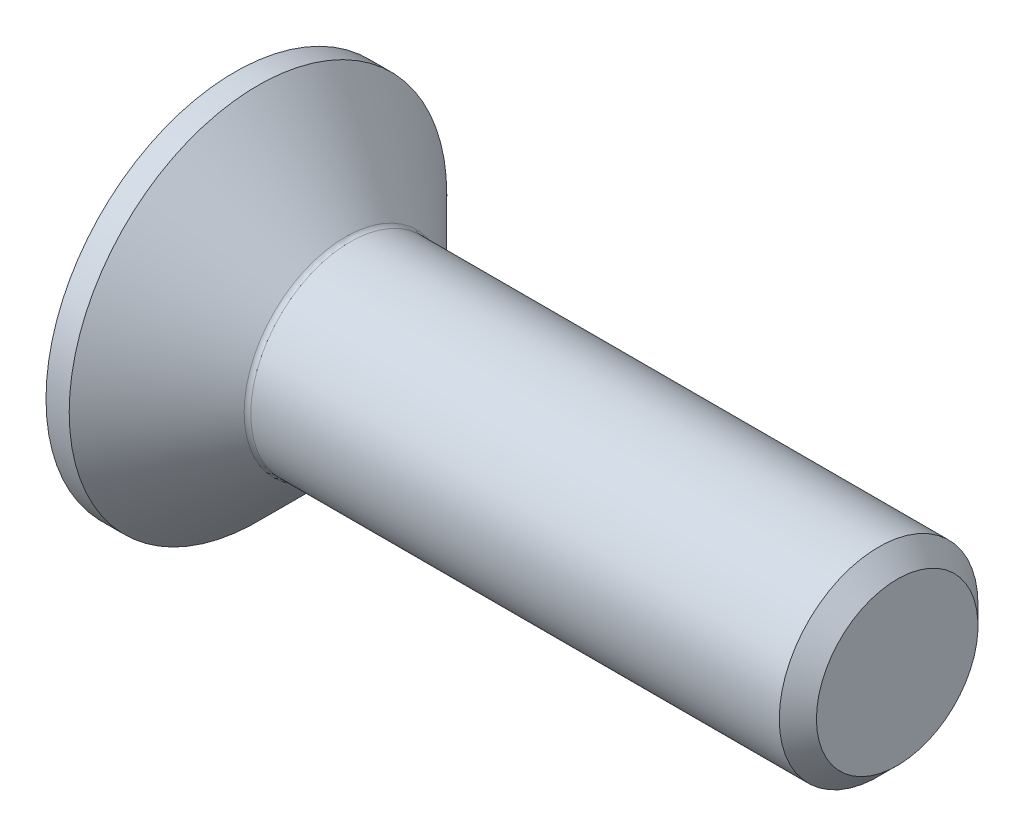
ISO-10303-21;
HEADER;
FILE_DESCRIPTION(('STEP AP214'),'2;1');
FILE_NAME('part.step','',(''),(''),'','','');
FILE_SCHEMA(('AUTOMOTIVE_DESIGN { 1 0 10303 214 1 1 1 1 }'));
ENDSEC;
DATA;
#1=APPLICATION_CONTEXT('core data for automotive mechanical design processes');
#2=APPLICATION_PROTOCOL_DEFINITION('international standard','automotive_design',2000,#1);
#3=PRODUCT_CONTEXT('',#1,'mechanical');
#4=PRODUCT('Part','Part','',(#3));
#5=PRODUCT_RELATED_PRODUCT_CATEGORY('part','',(#4));
#6=PRODUCT_DEFINITION_FORMATION('','',#4);
#7=PRODUCT_DEFINITION_CONTEXT('part definition',#1,'design');
#8=PRODUCT_DEFINITION('design','',#6,#7);
#9=PRODUCT_DEFINITION_SHAPE('','',#8);
#10=(LENGTH_UNIT() NAMED_UNIT(*) SI_UNIT(.MILLI.,.METRE.));
#11=(NAMED_UNIT(*) PLANE_ANGLE_UNIT() SI_UNIT($,.RADIAN.));
#12=(NAMED_UNIT(*) SI_UNIT($,.STERADIAN.) SOLID_ANGLE_UNIT());
#13=UNCERTAINTY_MEASURE_WITH_UNIT(LENGTH_MEASURE(1.E-05),#10,'distance_accuracy_value','');
#14=(GEOMETRIC_REPRESENTATION_CONTEXT(3) GLOBAL_UNCERTAINTY_ASSIGNED_CONTEXT((#13)) GLOBAL_UNIT_ASSIGNED_CONTEXT((#10,
#11,#12)) REPRESENTATION_CONTEXT('',''));
#15=CARTESIAN_POINT('',(0.,0.,0.));
#16=DIRECTION('',(0.,0.,1.));
#17=DIRECTION('',(1.,0.,0.));
#18=AXIS2_PLACEMENT_3D('',#15,#16,#17);
#19=CARTESIAN_POINT('',(0.,0.,0.));
#20=DIRECTION('',(-1.,0.,0.));
#21=DIRECTION('',(0.,0.,1.));
#22=AXIS2_PLACEMENT_3D('',#19,#20,#21);
#23=PLANE('',#22);
#24=CARTESIAN_POINT('',(0.,0.,0.));
#25=DIRECTION('',(-1.,0.,0.));
#26=DIRECTION('',(0.,0.,1.));
#27=AXIS2_PLACEMENT_3D('',#24,#25,#26);
#28=CIRCLE('',#27,2.85);
#29=CARTESIAN_POINT('',(0.,0.,2.85));
#30=VERTEX_POINT('',#29);
#31=EDGE_CURVE('E156',#30,#30,#28,.T.);
#32=ORIENTED_EDGE('',*,*,#31,.T.);
#33=EDGE_LOOP('',(#32));
#34=FACE_BOUND('',#33,.T.);
#35=DIRECTION('',(0.,-0.5,-0.866025403784439));
#36=VECTOR('',#35,1.);
#37=CARTESIAN_POINT('',(0.,-0.583123771881522,1.01));
#38=LINE('',#37,#36);
#39=CARTESIAN_POINT('',(0.,-0.583123771881522,1.01));
#40=VERTEX_POINT('',#39);
#41=CARTESIAN_POINT('',(0.,-1.16624754376304,0.));
#42=VERTEX_POINT('',#41);
#43=EDGE_CURVE('E122',#40,#42,#38,.T.);
#44=ORIENTED_EDGE('',*,*,#43,.T.);
#45=DIRECTION('',(0.,0.5,-0.866025403784439));
#46=VECTOR('',#45,1.);
#47=CARTESIAN_POINT('',(0.,-1.16624754376304,0.));
#48=LINE('',#47,#46);
#49=CARTESIAN_POINT('',(0.,-0.583123771881522,-1.01));
#50=VERTEX_POINT('',#49);
#51=EDGE_CURVE('E53',#42,#50,#48,.T.);
#52=ORIENTED_EDGE('',*,*,#51,.T.);
#53=DIRECTION('',(0.,1.,0.));
#54=VECTOR('',#53,1.);
#55=CARTESIAN_POINT('',(0.,-0.583123771881522,-1.01));
#56=LINE('',#55,#54);
#57=CARTESIAN_POINT('',(0.,0.583123771881523,-1.01));
#58=VERTEX_POINT('',#57);
#59=EDGE_CURVE('E133',#50,#58,#56,.T.);
#60=ORIENTED_EDGE('',*,*,#59,.T.);
#61=DIRECTION('',(0.,0.5,0.866025403784439));
#62=VECTOR('',#61,1.);
#63=CARTESIAN_POINT('',(0.,0.583123771881523,-1.01));
#64=LINE('',#63,#62);
#65=CARTESIAN_POINT('',(0.,1.16624754376304,0.));
#66=VERTEX_POINT('',#65);
#67=EDGE_CURVE('E257',#58,#66,#64,.T.);
#68=ORIENTED_EDGE('',*,*,#67,.T.);
#69=DIRECTION('',(0.,-0.5,0.866025403784439));
#70=VECTOR('',#69,1.);
#71=CARTESIAN_POINT('',(0.,1.16624754376304,0.));
#72=LINE('',#71,#70);
#73=CARTESIAN_POINT('',(0.,0.583123771881523,1.01));
#74=VERTEX_POINT('',#73);
#75=EDGE_CURVE('E260',#66,#74,#72,.T.);
#76=ORIENTED_EDGE('',*,*,#75,.T.);
#77=DIRECTION('',(0.,-1.,0.));
#78=VECTOR('',#77,1.);
#79=CARTESIAN_POINT('',(0.,0.583123771881523,1.01));
#80=LINE('',#79,#78);
#81=EDGE_CURVE('E263',#74,#40,#80,.T.);
#82=ORIENTED_EDGE('',*,*,#81,.T.);
#83=EDGE_LOOP('',(#44,#52,#60,#68,#76,#82));
#84=FACE_BOUND('',#83,.T.);
#85=ADVANCED_FACE('F38',(#34,#84),#23,.T.);
#86=CARTESIAN_POINT('',(0.,0.,0.));
#87=DIRECTION('',(-1.,0.,0.));
#88=DIRECTION('',(0.,0.,1.));
#89=AXIS2_PLACEMENT_3D('',#86,#87,#88);
#90=CYLINDRICAL_SURFACE('',#89,2.85);
#91=CARTESIAN_POINT('',(0.350000000000006,0.,0.));
#92=DIRECTION('',(-1.,0.,0.));
#93=DIRECTION('',(0.,0.,1.));
#94=AXIS2_PLACEMENT_3D('',#91,#92,#93);
#95=CIRCLE('',#94,2.85);
#96=CARTESIAN_POINT('',(0.350000000000006,0.,2.85));
#97=VERTEX_POINT('',#96);
#98=EDGE_CURVE('E153',#97,#97,#95,.T.);
#99=ORIENTED_EDGE('',*,*,#98,.T.);
#100=EDGE_LOOP('',(#99));
#101=FACE_BOUND('',#100,.T.);
#102=ORIENTED_EDGE('',*,*,#31,.F.);
#103=EDGE_LOOP('',(#102));
#104=FACE_BOUND('',#103,.T.);
#105=ADVANCED_FACE('F177',(#101,#104),#90,.T.);
#106=CARTESIAN_POINT('',(0.350000000000006,0.,0.));
#107=DIRECTION('',(-1.,0.,0.));
#108=DIRECTION('',(0.,0.,1.));
#109=AXIS2_PLACEMENT_3D('',#106,#107,#108);
#110=CONICAL_SURFACE('',#109,2.85,0.78539816339745);
#111=CARTESIAN_POINT('',(1.67071067811868,0.,0.));
#112=DIRECTION('',(-1.,0.,0.));
#113=DIRECTION('',(0.,0.,1.));
#114=AXIS2_PLACEMENT_3D('',#111,#112,#113);
#115=CIRCLE('',#114,1.52928932188132);
#116=CARTESIAN_POINT('',(1.67071067811868,0.,1.52928932188132));
#117=VERTEX_POINT('',#116);
#118=EDGE_CURVE('E46',#117,#117,#115,.T.);
#119=ORIENTED_EDGE('',*,*,#118,.T.);
#120=EDGE_LOOP('',(#119));
#121=FACE_BOUND('',#120,.T.);
#122=ORIENTED_EDGE('',*,*,#98,.F.);
#123=EDGE_LOOP('',(#122));
#124=FACE_BOUND('',#123,.T.);
#125=ADVANCED_FACE('F161',(#121,#124),#110,.T.);
#126=CARTESIAN_POINT('',(0.,0.,0.));
#127=DIRECTION('',(-1.,0.,0.));
#128=DIRECTION('',(0.,0.,1.));
#129=AXIS2_PLACEMENT_3D('',#126,#127,#128);
#130=CYLINDRICAL_SURFACE('',#129,1.49999999999998);
#131=CARTESIAN_POINT('',(1.74142135623733,0.,0.));
#132=DIRECTION('',(-1.,0.,0.));
#133=DIRECTION('',(0.,0.,1.));
#134=AXIS2_PLACEMENT_3D('',#131,#132,#133);
#135=CIRCLE('',#134,1.49999999999998);
#136=CARTESIAN_POINT('',(1.74142135623733,0.,1.49999999999998));
#137=VERTEX_POINT('',#136);
#138=EDGE_CURVE('E11',#137,#137,#135,.F.);
#139=ORIENTED_EDGE('',*,*,#138,.T.);
#140=EDGE_LOOP('',(#139));
#141=FACE_BOUND('',#140,.T.);
#142=CARTESIAN_POINT('',(9.71949999999996,0.,0.));
#143=DIRECTION('',(-1.,0.,0.));
#144=DIRECTION('',(0.,0.,1.));
#145=AXIS2_PLACEMENT_3D('',#142,#143,#144);
#146=CIRCLE('',#145,1.49999999999995);
#147=CARTESIAN_POINT('',(9.71949999999996,0.,1.49999999999995));
#148=VERTEX_POINT('',#147);
#149=EDGE_CURVE('E150',#148,#148,#146,.T.);
#150=ORIENTED_EDGE('',*,*,#149,.T.);
#151=EDGE_LOOP('',(#150));
#152=FACE_BOUND('',#151,.T.);
#153=ADVANCED_FACE('F188',(#141,#152),#130,.T.);
#154=CARTESIAN_POINT('',(10.,0.,0.));
#155=DIRECTION('',(-1.,0.,0.));
#156=DIRECTION('',(0.,0.,1.));
#157=AXIS2_PLACEMENT_3D('',#154,#155,#156);
#158=CONICAL_SURFACE('',#157,1.2195,0.785398163397301);
#159=ORIENTED_EDGE('',*,*,#149,.F.);
#160=EDGE_LOOP('',(#159));
#161=FACE_BOUND('',#160,.T.);
#162=CARTESIAN_POINT('',(10.,0.,0.));
#163=DIRECTION('',(-1.,0.,0.));
#164=DIRECTION('',(0.,0.,1.));
#165=AXIS2_PLACEMENT_3D('',#162,#163,#164);
#166=CIRCLE('',#165,1.2195);
#167=CARTESIAN_POINT('',(10.,0.,1.2195));
#168=VERTEX_POINT('',#167);
#169=EDGE_CURVE('E146',#168,#168,#166,.T.);
#170=ORIENTED_EDGE('',*,*,#169,.T.);
#171=EDGE_LOOP('',(#170));
#172=FACE_BOUND('',#171,.T.);
#173=ADVANCED_FACE('F172',(#161,#172),#158,.T.);
#174=CARTESIAN_POINT('',(10.,1.2195,0.));
#175=DIRECTION('',(1.,0.,0.));
#176=DIRECTION('',(0.,0.,-1.));
#177=AXIS2_PLACEMENT_3D('',#174,#175,#176);
#178=PLANE('',#177);
#179=ORIENTED_EDGE('',*,*,#169,.F.);
#180=EDGE_LOOP('',(#179));
#181=FACE_BOUND('',#180,.T.);
#182=ADVANCED_FACE('F165',(#181),#178,.T.);
#183=CARTESIAN_POINT('',(1.74142135623733,0.,0.));
#184=DIRECTION('',(-1.,0.,0.));
#185=DIRECTION('',(0.,0.,1.));
#186=AXIS2_PLACEMENT_3D('',#183,#184,#185);
#187=TOROIDAL_SURFACE('',#186,1.59999999999998,0.1);
#188=ORIENTED_EDGE('',*,*,#138,.F.);
#189=EDGE_LOOP('',(#188));
#190=FACE_BOUND('',#189,.T.);
#191=ORIENTED_EDGE('',*,*,#118,.F.);
#192=EDGE_LOOP('',(#191));
#193=FACE_BOUND('',#192,.T.);
#194=ADVANCED_FACE('F40',(#190,#193),#187,.F.);
#195=CARTESIAN_POINT('',(1.2,-1.16624754376304,0.));
#196=DIRECTION('',(0.,0.866025403784439,0.5));
#197=DIRECTION('',(0.,-0.5,0.866025403784439));
#198=AXIS2_PLACEMENT_3D('',#195,#196,#197);
#199=PLANE('',#198);
#200=ORIENTED_EDGE('',*,*,#51,.F.);
#201=DIRECTION('',(-1.,0.,0.));
#202=VECTOR('',#201,1.);
#203=CARTESIAN_POINT('',(1.2,-1.16624754376304,0.));
#204=LINE('',#203,#202);
#205=CARTESIAN_POINT('',(1.2,-1.16624754376304,0.));
#206=VERTEX_POINT('',#205);
#207=EDGE_CURVE('E254',#206,#42,#204,.T.);
#208=ORIENTED_EDGE('',*,*,#207,.F.);
#209=DIRECTION('',(0.,0.5,-0.866025403784439));
#210=VECTOR('',#209,1.);
#211=CARTESIAN_POINT('',(1.2,-1.16624754376304,0.));
#212=LINE('',#211,#210);
#213=CARTESIAN_POINT('',(1.2,-0.874685657822283,-0.505));
#214=VERTEX_POINT('',#213);
#215=EDGE_CURVE('E118',#206,#214,#212,.T.);
#216=ORIENTED_EDGE('',*,*,#215,.T.);
#217=CARTESIAN_POINT('',(1.2,-0.583123771881522,-1.01));
#218=VERTEX_POINT('',#217);
#219=EDGE_CURVE('E114',#214,#218,#212,.T.);
#220=ORIENTED_EDGE('',*,*,#219,.T.);
#221=DIRECTION('',(-1.,0.,0.));
#222=VECTOR('',#221,1.);
#223=CARTESIAN_POINT('',(1.2,-0.583123771881522,-1.01));
#224=LINE('',#223,#222);
#225=EDGE_CURVE('E116',#218,#50,#224,.T.);
#226=ORIENTED_EDGE('',*,*,#225,.T.);
#227=EDGE_LOOP('',(#200,#208,#216,#220,#226));
#228=FACE_BOUND('',#227,.T.);
#229=ADVANCED_FACE('F115',(#228),#199,.T.);
#230=CARTESIAN_POINT('',(1.2,-0.583123771881522,-1.01));
#231=DIRECTION('',(0.,0.,1.));
#232=DIRECTION('',(1.,0.,0.));
#233=AXIS2_PLACEMENT_3D('',#230,#231,#232);
#234=PLANE('',#233);
#235=ORIENTED_EDGE('',*,*,#59,.F.);
#236=ORIENTED_EDGE('',*,*,#225,.F.);
#237=DIRECTION('',(0.,1.,0.));
#238=VECTOR('',#237,1.);
#239=CARTESIAN_POINT('',(1.2,-0.583123771881522,-1.01));
#240=LINE('',#239,#238);
#241=CARTESIAN_POINT('',(1.2,0.,-1.01));
#242=VERTEX_POINT('',#241);
#243=EDGE_CURVE('E61',#218,#242,#240,.T.);
#244=ORIENTED_EDGE('',*,*,#243,.T.);
#245=CARTESIAN_POINT('',(1.2,0.583123771881523,-1.01));
#246=VERTEX_POINT('',#245);
#247=EDGE_CURVE('E128',#242,#246,#240,.T.);
#248=ORIENTED_EDGE('',*,*,#247,.T.);
#249=DIRECTION('',(-1.,0.,0.));
#250=VECTOR('',#249,1.);
#251=CARTESIAN_POINT('',(1.2,0.583123771881523,-1.01));
#252=LINE('',#251,#250);
#253=EDGE_CURVE('E135',#246,#58,#252,.T.);
#254=ORIENTED_EDGE('',*,*,#253,.T.);
#255=EDGE_LOOP('',(#235,#236,#244,#248,#254));
#256=FACE_BOUND('',#255,.T.);
#257=ADVANCED_FACE('F130',(#256),#234,.T.);
#258=CARTESIAN_POINT('',(1.2,0.583123771881523,-1.01));
#259=DIRECTION('',(0.,-0.866025403784439,0.5));
#260=DIRECTION('',(0.,-0.5,-0.866025403784439));
#261=AXIS2_PLACEMENT_3D('',#258,#259,#260);
#262=PLANE('',#261);
#263=ORIENTED_EDGE('',*,*,#67,.F.);
#264=ORIENTED_EDGE('',*,*,#253,.F.);
#265=DIRECTION('',(0.,0.5,0.866025403784439));
#266=VECTOR('',#265,1.);
#267=CARTESIAN_POINT('',(1.2,0.583123771881523,-1.01));
#268=LINE('',#267,#266);
#269=CARTESIAN_POINT('',(1.2,0.874685657822283,-0.505));
#270=VERTEX_POINT('',#269);
#271=EDGE_CURVE('E235',#246,#270,#268,.T.);
#272=ORIENTED_EDGE('',*,*,#271,.T.);
#273=CARTESIAN_POINT('',(1.2,1.16624754376304,0.));
#274=VERTEX_POINT('',#273);
#275=EDGE_CURVE('E127',#270,#274,#268,.T.);
#276=ORIENTED_EDGE('',*,*,#275,.T.);
#277=DIRECTION('',(-1.,0.,0.));
#278=VECTOR('',#277,1.);
#279=CARTESIAN_POINT('',(1.2,1.16624754376304,0.));
#280=LINE('',#279,#278);
#281=EDGE_CURVE('E141',#274,#66,#280,.T.);
#282=ORIENTED_EDGE('',*,*,#281,.T.);
#283=EDGE_LOOP('',(#263,#264,#272,#276,#282));
#284=FACE_BOUND('',#283,.T.);
#285=ADVANCED_FACE('F202',(#284),#262,.T.);
#286=CARTESIAN_POINT('',(1.2,1.16624754376304,0.));
#287=DIRECTION('',(0.,-0.866025403784439,-0.5));
#288=DIRECTION('',(0.,0.5,-0.866025403784439));
#289=AXIS2_PLACEMENT_3D('',#286,#287,#288);
#290=PLANE('',#289);
#291=ORIENTED_EDGE('',*,*,#75,.F.);
#292=ORIENTED_EDGE('',*,*,#281,.F.);
#293=DIRECTION('',(0.,-0.5,0.866025403784439));
#294=VECTOR('',#293,1.);
#295=CARTESIAN_POINT('',(1.2,1.16624754376304,0.));
#296=LINE('',#295,#294);
#297=CARTESIAN_POINT('',(1.2,0.874685657822284,0.505));
#298=VERTEX_POINT('',#297);
#299=EDGE_CURVE('E242',#274,#298,#296,.T.);
#300=ORIENTED_EDGE('',*,*,#299,.T.);
#301=CARTESIAN_POINT('',(1.2,0.583123771881523,1.01));
#302=VERTEX_POINT('',#301);
#303=EDGE_CURVE('E240',#298,#302,#296,.T.);
#304=ORIENTED_EDGE('',*,*,#303,.T.);
#305=DIRECTION('',(-1.,0.,0.));
#306=VECTOR('',#305,1.);
#307=CARTESIAN_POINT('',(1.2,0.583123771881523,1.01));
#308=LINE('',#307,#306);
#309=EDGE_CURVE('E272',#302,#74,#308,.T.);
#310=ORIENTED_EDGE('',*,*,#309,.T.);
#311=EDGE_LOOP('',(#291,#292,#300,#304,#310));
#312=FACE_BOUND('',#311,.T.);
#313=ADVANCED_FACE('F205',(#312),#290,.T.);
#314=CARTESIAN_POINT('',(1.2,0.583123771881523,1.01));
#315=DIRECTION('',(0.,0.,-1.));
#316=DIRECTION('',(-1.,0.,0.));
#317=AXIS2_PLACEMENT_3D('',#314,#315,#316);
#318=PLANE('',#317);
#319=ORIENTED_EDGE('',*,*,#81,.F.);
#320=ORIENTED_EDGE('',*,*,#309,.F.);
#321=DIRECTION('',(0.,-1.,0.));
#322=VECTOR('',#321,1.);
#323=CARTESIAN_POINT('',(1.2,0.583123771881523,1.01));
#324=LINE('',#323,#322);
#325=CARTESIAN_POINT('',(1.2,0.,1.01));
#326=VERTEX_POINT('',#325);
#327=EDGE_CURVE('E247',#302,#326,#324,.T.);
#328=ORIENTED_EDGE('',*,*,#327,.T.);
#329=CARTESIAN_POINT('',(1.2,-0.583123771881522,1.01));
#330=VERTEX_POINT('',#329);
#331=EDGE_CURVE('E246',#326,#330,#324,.T.);
#332=ORIENTED_EDGE('',*,*,#331,.T.);
#333=DIRECTION('',(-1.,0.,0.));
#334=VECTOR('',#333,1.);
#335=CARTESIAN_POINT('',(1.2,-0.583123771881522,1.01));
#336=LINE('',#335,#334);
#337=EDGE_CURVE('E269',#330,#40,#336,.T.);
#338=ORIENTED_EDGE('',*,*,#337,.T.);
#339=EDGE_LOOP('',(#319,#320,#328,#332,#338));
#340=FACE_BOUND('',#339,.T.);
#341=ADVANCED_FACE('F209',(#340),#318,.T.);
#342=CARTESIAN_POINT('',(1.2,-0.583123771881522,1.01));
#343=DIRECTION('',(0.,0.866025403784439,-0.5));
#344=DIRECTION('',(0.,0.5,0.866025403784439));
#345=AXIS2_PLACEMENT_3D('',#342,#343,#344);
#346=PLANE('',#345);
#347=ORIENTED_EDGE('',*,*,#43,.F.);
#348=ORIENTED_EDGE('',*,*,#337,.F.);
#349=DIRECTION('',(0.,-0.5,-0.866025403784439));
#350=VECTOR('',#349,1.);
#351=CARTESIAN_POINT('',(1.2,-0.583123771881522,1.01));
#352=LINE('',#351,#350);
#353=CARTESIAN_POINT('',(1.2,-0.874685657822283,0.505));
#354=VERTEX_POINT('',#353);
#355=EDGE_CURVE('E251',#330,#354,#352,.T.);
#356=ORIENTED_EDGE('',*,*,#355,.T.);
#357=EDGE_CURVE('E250',#354,#206,#352,.T.);
#358=ORIENTED_EDGE('',*,*,#357,.T.);
#359=ORIENTED_EDGE('',*,*,#207,.T.);
#360=EDGE_LOOP('',(#347,#348,#356,#358,#359));
#361=FACE_BOUND('',#360,.T.);
#362=ADVANCED_FACE('F213',(#361),#346,.T.);
#363=CARTESIAN_POINT('',(1.2,-0.583123771881522,-1.01));
#364=DIRECTION('',(1.,0.,0.));
#365=DIRECTION('',(0.,0.,-1.));
#366=AXIS2_PLACEMENT_3D('',#363,#364,#365);
#367=PLANE('',#366);
#368=ORIENTED_EDGE('',*,*,#243,.F.);
#369=ORIENTED_EDGE('',*,*,#219,.F.);
#370=CARTESIAN_POINT('',(1.2,0.,0.));
#371=DIRECTION('',(-1.,0.,0.));
#372=DIRECTION('',(0.,0.,1.));
#373=AXIS2_PLACEMENT_3D('',#370,#371,#372);
#374=CIRCLE('',#373,1.01);
#375=EDGE_CURVE('E125',#242,#214,#374,.T.);
#376=ORIENTED_EDGE('',*,*,#375,.F.);
#377=EDGE_LOOP('',(#368,#369,#376));
#378=FACE_BOUND('',#377,.T.);
#379=ADVANCED_FACE('F124',(#378),#367,.F.);
#380=ORIENTED_EDGE('',*,*,#215,.F.);
#381=ORIENTED_EDGE('',*,*,#357,.F.);
#382=EDGE_CURVE('E138',#214,#354,#374,.T.);
#383=ORIENTED_EDGE('',*,*,#382,.F.);
#384=EDGE_LOOP('',(#380,#381,#383));
#385=FACE_BOUND('',#384,.T.);
#386=ADVANCED_FACE('F219',(#385),#367,.F.);
#387=ORIENTED_EDGE('',*,*,#355,.F.);
#388=ORIENTED_EDGE('',*,*,#331,.F.);
#389=EDGE_CURVE('E134',#354,#326,#374,.T.);
#390=ORIENTED_EDGE('',*,*,#389,.F.);
#391=EDGE_LOOP('',(#387,#388,#390));
#392=FACE_BOUND('',#391,.T.);
#393=ADVANCED_FACE('F223',(#392),#367,.F.);
#394=ORIENTED_EDGE('',*,*,#327,.F.);
#395=ORIENTED_EDGE('',*,*,#303,.F.);
#396=EDGE_CURVE('E140',#326,#298,#374,.T.);
#397=ORIENTED_EDGE('',*,*,#396,.F.);
#398=EDGE_LOOP('',(#394,#395,#397));
#399=FACE_BOUND('',#398,.T.);
#400=ADVANCED_FACE('F231',(#399),#367,.F.);
#401=ORIENTED_EDGE('',*,*,#299,.F.);
#402=ORIENTED_EDGE('',*,*,#275,.F.);
#403=EDGE_CURVE('E147',#298,#270,#374,.T.);
#404=ORIENTED_EDGE('',*,*,#403,.F.);
#405=EDGE_LOOP('',(#401,#402,#404));
#406=FACE_BOUND('',#405,.T.);
#407=ADVANCED_FACE('F226',(#406),#367,.F.);
#408=ORIENTED_EDGE('',*,*,#271,.F.);
#409=ORIENTED_EDGE('',*,*,#247,.F.);
#410=EDGE_CURVE('E236',#270,#242,#374,.T.);
#411=ORIENTED_EDGE('',*,*,#410,.F.);
#412=EDGE_LOOP('',(#408,#409,#411));
#413=FACE_BOUND('',#412,.T.);
#414=ADVANCED_FACE('F197',(#413),#367,.F.);
#415=CARTESIAN_POINT('',(1.2,0.,0.));
#416=DIRECTION('',(-1.,0.,0.));
#417=DIRECTION('',(0.,0.,1.));
#418=AXIS2_PLACEMENT_3D('',#415,#416,#417);
#419=CONICAL_SURFACE('',#418,1.01,1.04719755119659);
#420=CARTESIAN_POINT('',(1.78312377188153,0.,0.));
#421=VERTEX_POINT('',#420);
#422=VERTEX_LOOP('',#421);
#423=FACE_BOUND('',#422,.T.);
#424=ORIENTED_EDGE('',*,*,#396,.T.);
#425=ORIENTED_EDGE('',*,*,#403,.T.);
#426=ORIENTED_EDGE('',*,*,#410,.T.);
#427=ORIENTED_EDGE('',*,*,#375,.T.);
#428=ORIENTED_EDGE('',*,*,#382,.T.);
#429=ORIENTED_EDGE('',*,*,#389,.T.);
#430=EDGE_LOOP('',(#424,#425,#426,#427,#428,#429));
#431=FACE_BOUND('',#430,.T.);
#432=ADVANCED_FACE('F195',(#423,#431),#419,.F.);
#433=CLOSED_SHELL('',(#85,#105,#125,#153,#173,#182,#194,#229,#257,#285,#313,#341,#362,#379,#386,
#393,#400,#407,#414,#432));
#434=MANIFOLD_SOLID_BREP('B2',#433);
#435=ADVANCED_BREP_SHAPE_REPRESENTATION('',(#18,#434),#14);
#436=SHAPE_DEFINITION_REPRESENTATION(#9,#435);
ENDSEC;
END-ISO-10303-21;
